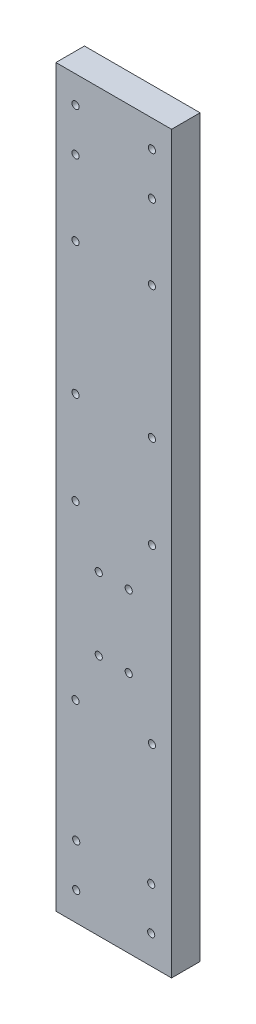
ISO-10303-21;
HEADER;
FILE_DESCRIPTION(('STEP AP214'),'2;1');
FILE_NAME('part.step','',(''),(''),'','','');
FILE_SCHEMA(('AUTOMOTIVE_DESIGN { 1 0 10303 214 1 1 1 1 }'));
ENDSEC;
DATA;
#1=APPLICATION_CONTEXT('core data for automotive mechanical design processes');
#2=APPLICATION_PROTOCOL_DEFINITION('international standard','automotive_design',2000,#1);
#3=PRODUCT_CONTEXT('',#1,'mechanical');
#4=PRODUCT('Part','Part','',(#3));
#5=PRODUCT_RELATED_PRODUCT_CATEGORY('part','',(#4));
#6=PRODUCT_DEFINITION_FORMATION('','',#4);
#7=PRODUCT_DEFINITION_CONTEXT('part definition',#1,'design');
#8=PRODUCT_DEFINITION('design','',#6,#7);
#9=PRODUCT_DEFINITION_SHAPE('','',#8);
#10=(LENGTH_UNIT() NAMED_UNIT(*) SI_UNIT(.MILLI.,.METRE.));
#11=(NAMED_UNIT(*) PLANE_ANGLE_UNIT() SI_UNIT($,.RADIAN.));
#12=(NAMED_UNIT(*) SI_UNIT($,.STERADIAN.) SOLID_ANGLE_UNIT());
#13=UNCERTAINTY_MEASURE_WITH_UNIT(LENGTH_MEASURE(1.E-05),#10,'distance_accuracy_value','');
#14=(GEOMETRIC_REPRESENTATION_CONTEXT(3) GLOBAL_UNCERTAINTY_ASSIGNED_CONTEXT((#13)) GLOBAL_UNIT_ASSIGNED_CONTEXT((#10,
#11,#12)) REPRESENTATION_CONTEXT('',''));
#15=CARTESIAN_POINT('',(0.,0.,0.));
#16=DIRECTION('',(0.,0.,1.));
#17=DIRECTION('',(1.,0.,0.));
#18=AXIS2_PLACEMENT_3D('',#15,#16,#17);
#19=CARTESIAN_POINT('',(0.,0.,4.));
#20=DIRECTION('',(0.,0.,-1.));
#21=DIRECTION('',(-1.,0.,0.));
#22=AXIS2_PLACEMENT_3D('',#19,#20,#21);
#23=PLANE('',#22);
#24=CARTESIAN_POINT('',(13.4499999999989,99.165,4.));
#25=DIRECTION('',(0.,0.,1.));
#26=DIRECTION('',(-1.,0.,0.));
#27=AXIS2_PLACEMENT_3D('',#24,#25,#26);
#28=CIRCLE('',#27,0.499999999999994);
#29=CARTESIAN_POINT('',(12.9499999999989,99.165,4.));
#30=VERTEX_POINT('',#29);
#31=EDGE_CURVE('E217',#30,#30,#28,.T.);
#32=ORIENTED_EDGE('',*,*,#31,.F.);
#33=EDGE_LOOP('',(#32));
#34=FACE_BOUND('',#33,.T.);
#35=CARTESIAN_POINT('',(13.350000000001,10.,4.));
#36=DIRECTION('',(0.,0.,1.));
#37=DIRECTION('',(-1.,0.,0.));
#38=AXIS2_PLACEMENT_3D('',#35,#36,#37);
#39=CIRCLE('',#38,0.499999999999995);
#40=CARTESIAN_POINT('',(12.850000000001,10.,4.));
#41=VERTEX_POINT('',#40);
#42=EDGE_CURVE('E205',#41,#41,#39,.T.);
#43=ORIENTED_EDGE('',*,*,#42,.F.);
#44=EDGE_LOOP('',(#43));
#45=FACE_BOUND('',#44,.T.);
#46=CARTESIAN_POINT('',(2.85,10.,4.));
#47=DIRECTION('',(0.,0.,1.));
#48=DIRECTION('',(1.,0.,0.));
#49=AXIS2_PLACEMENT_3D('',#46,#47,#48);
#50=CIRCLE('',#49,0.499999999999999);
#51=CARTESIAN_POINT('',(3.35,10.,4.));
#52=VERTEX_POINT('',#51);
#53=EDGE_CURVE('E193',#52,#52,#50,.T.);
#54=ORIENTED_EDGE('',*,*,#53,.F.);
#55=EDGE_LOOP('',(#54));
#56=FACE_BOUND('',#55,.T.);
#57=CARTESIAN_POINT('',(13.4499999999999,93.165,4.));
#58=DIRECTION('',(0.,0.,1.));
#59=DIRECTION('',(1.,0.,0.));
#60=AXIS2_PLACEMENT_3D('',#57,#58,#59);
#61=CIRCLE('',#60,0.499999999999994);
#62=CARTESIAN_POINT('',(13.9499999999999,93.165,4.));
#63=VERTEX_POINT('',#62);
#64=EDGE_CURVE('E181',#63,#63,#61,.T.);
#65=ORIENTED_EDGE('',*,*,#64,.F.);
#66=EDGE_LOOP('',(#65));
#67=FACE_BOUND('',#66,.T.);
#68=CARTESIAN_POINT('',(13.4499999999987,82.665,4.));
#69=DIRECTION('',(0.,0.,1.));
#70=DIRECTION('',(1.,0.,0.));
#71=AXIS2_PLACEMENT_3D('',#68,#69,#70);
#72=CIRCLE('',#71,0.499999999999994);
#73=CARTESIAN_POINT('',(13.9499999999987,82.665,4.));
#74=VERTEX_POINT('',#73);
#75=EDGE_CURVE('E169',#74,#74,#72,.T.);
#76=ORIENTED_EDGE('',*,*,#75,.F.);
#77=EDGE_LOOP('',(#76));
#78=FACE_BOUND('',#77,.T.);
#79=CARTESIAN_POINT('',(13.45,27.,4.));
#80=DIRECTION('',(0.,0.,1.));
#81=DIRECTION('',(1.,0.,0.));
#82=AXIS2_PLACEMENT_3D('',#79,#80,#81);
#83=CIRCLE('',#82,0.499999999999993);
#84=CARTESIAN_POINT('',(13.95,27.,4.));
#85=VERTEX_POINT('',#84);
#86=EDGE_CURVE('E157',#85,#85,#83,.T.);
#87=ORIENTED_EDGE('',*,*,#86,.F.);
#88=EDGE_LOOP('',(#87));
#89=FACE_BOUND('',#88,.T.);
#90=CARTESIAN_POINT('',(10.2,34.,4.));
#91=DIRECTION('',(0.,0.,1.));
#92=DIRECTION('',(1.,0.,0.));
#93=AXIS2_PLACEMENT_3D('',#90,#91,#92);
#94=CIRCLE('',#93,0.499999999999999);
#95=CARTESIAN_POINT('',(10.7,34.,4.));
#96=VERTEX_POINT('',#95);
#97=EDGE_CURVE('E145',#96,#96,#94,.T.);
#98=ORIENTED_EDGE('',*,*,#97,.F.);
#99=EDGE_LOOP('',(#98));
#100=FACE_BOUND('',#99,.T.);
#101=CARTESIAN_POINT('',(13.4500000000003,64.14,4.));
#102=DIRECTION('',(0.,0.,1.));
#103=DIRECTION('',(1.,0.,0.));
#104=AXIS2_PLACEMENT_3D('',#101,#102,#103);
#105=CIRCLE('',#104,0.499999999999994);
#106=CARTESIAN_POINT('',(13.9500000000003,64.14,4.));
#107=VERTEX_POINT('',#106);
#108=EDGE_CURVE('E133',#107,#107,#105,.T.);
#109=ORIENTED_EDGE('',*,*,#108,.F.);
#110=EDGE_LOOP('',(#109));
#111=FACE_BOUND('',#110,.T.);
#112=CARTESIAN_POINT('',(13.45,51.14,4.));
#113=DIRECTION('',(0.,0.,1.));
#114=DIRECTION('',(1.,0.,0.));
#115=AXIS2_PLACEMENT_3D('',#112,#113,#114);
#116=CIRCLE('',#115,0.499999999999999);
#117=CARTESIAN_POINT('',(13.95,51.14,4.));
#118=VERTEX_POINT('',#117);
#119=EDGE_CURVE('E121',#118,#118,#116,.T.);
#120=ORIENTED_EDGE('',*,*,#119,.F.);
#121=EDGE_LOOP('',(#120));
#122=FACE_BOUND('',#121,.T.);
#123=CARTESIAN_POINT('',(10.2,44.14,4.));
#124=DIRECTION('',(0.,0.,1.));
#125=DIRECTION('',(1.,0.,0.));
#126=AXIS2_PLACEMENT_3D('',#123,#124,#125);
#127=CIRCLE('',#126,0.499999999999999);
#128=CARTESIAN_POINT('',(10.7,44.14,4.));
#129=VERTEX_POINT('',#128);
#130=EDGE_CURVE('E100',#129,#129,#127,.T.);
#131=ORIENTED_EDGE('',*,*,#130,.F.);
#132=EDGE_LOOP('',(#131));
#133=FACE_BOUND('',#132,.T.);
#134=DIRECTION('',(1.,0.,0.));
#135=VECTOR('',#134,1.);
#136=CARTESIAN_POINT('',(0.,0.,4.));
#137=LINE('',#136,#135);
#138=CARTESIAN_POINT('',(0.,0.,4.));
#139=VERTEX_POINT('',#138);
#140=CARTESIAN_POINT('',(16.2,0.,4.));
#141=VERTEX_POINT('',#140);
#142=EDGE_CURVE('E85',#139,#141,#137,.T.);
#143=ORIENTED_EDGE('',*,*,#142,.T.);
#144=DIRECTION('',(0.,1.,0.));
#145=VECTOR('',#144,1.);
#146=CARTESIAN_POINT('',(16.2,102.96,4.));
#147=LINE('',#146,#145);
#148=CARTESIAN_POINT('',(16.2,102.96,4.));
#149=VERTEX_POINT('',#148);
#150=EDGE_CURVE('E80',#141,#149,#147,.T.);
#151=ORIENTED_EDGE('',*,*,#150,.T.);
#152=DIRECTION('',(-1.,0.,0.));
#153=VECTOR('',#152,1.);
#154=CARTESIAN_POINT('',(0.,102.96,4.));
#155=LINE('',#154,#153);
#156=CARTESIAN_POINT('',(0.,102.96,4.));
#157=VERTEX_POINT('',#156);
#158=EDGE_CURVE('E83',#149,#157,#155,.T.);
#159=ORIENTED_EDGE('',*,*,#158,.T.);
#160=DIRECTION('',(0.,-1.,0.));
#161=VECTOR('',#160,1.);
#162=CARTESIAN_POINT('',(0.,102.96,4.));
#163=LINE('',#162,#161);
#164=EDGE_CURVE('E50',#157,#139,#163,.T.);
#165=ORIENTED_EDGE('',*,*,#164,.T.);
#166=EDGE_LOOP('',(#143,#151,#159,#165));
#167=FACE_BOUND('',#166,.T.);
#168=CARTESIAN_POINT('',(5.99999999999999,44.14,4.));
#169=DIRECTION('',(0.,0.,1.));
#170=DIRECTION('',(1.,0.,0.));
#171=AXIS2_PLACEMENT_3D('',#168,#169,#170);
#172=CIRCLE('',#171,0.500000000000002);
#173=CARTESIAN_POINT('',(6.5,44.14,4.));
#174=VERTEX_POINT('',#173);
#175=EDGE_CURVE('E115',#174,#174,#172,.T.);
#176=ORIENTED_EDGE('',*,*,#175,.F.);
#177=EDGE_LOOP('',(#176));
#178=FACE_BOUND('',#177,.T.);
#179=CARTESIAN_POINT('',(2.74999999999999,51.14,4.));
#180=DIRECTION('',(0.,0.,1.));
#181=DIRECTION('',(1.,0.,0.));
#182=AXIS2_PLACEMENT_3D('',#179,#180,#181);
#183=CIRCLE('',#182,0.499999999999999);
#184=CARTESIAN_POINT('',(3.24999999999999,51.14,4.));
#185=VERTEX_POINT('',#184);
#186=EDGE_CURVE('E127',#185,#185,#183,.T.);
#187=ORIENTED_EDGE('',*,*,#186,.F.);
#188=EDGE_LOOP('',(#187));
#189=FACE_BOUND('',#188,.T.);
#190=CARTESIAN_POINT('',(2.74999999999999,64.14,4.));
#191=DIRECTION('',(0.,0.,1.));
#192=DIRECTION('',(1.,0.,0.));
#193=AXIS2_PLACEMENT_3D('',#190,#191,#192);
#194=CIRCLE('',#193,0.499999999999999);
#195=CARTESIAN_POINT('',(3.24999999999999,64.14,4.));
#196=VERTEX_POINT('',#195);
#197=EDGE_CURVE('E139',#196,#196,#194,.T.);
#198=ORIENTED_EDGE('',*,*,#197,.F.);
#199=EDGE_LOOP('',(#198));
#200=FACE_BOUND('',#199,.T.);
#201=CARTESIAN_POINT('',(6.,34.,4.));
#202=DIRECTION('',(0.,0.,1.));
#203=DIRECTION('',(1.,0.,0.));
#204=AXIS2_PLACEMENT_3D('',#201,#202,#203);
#205=CIRCLE('',#204,0.5);
#206=CARTESIAN_POINT('',(6.5,34.,4.));
#207=VERTEX_POINT('',#206);
#208=EDGE_CURVE('E151',#207,#207,#205,.T.);
#209=ORIENTED_EDGE('',*,*,#208,.F.);
#210=EDGE_LOOP('',(#209));
#211=FACE_BOUND('',#210,.T.);
#212=CARTESIAN_POINT('',(2.75,27.,4.));
#213=DIRECTION('',(0.,0.,1.));
#214=DIRECTION('',(1.,0.,0.));
#215=AXIS2_PLACEMENT_3D('',#212,#213,#214);
#216=CIRCLE('',#215,0.499999999999999);
#217=CARTESIAN_POINT('',(3.25,27.,4.));
#218=VERTEX_POINT('',#217);
#219=EDGE_CURVE('E163',#218,#218,#216,.T.);
#220=ORIENTED_EDGE('',*,*,#219,.F.);
#221=EDGE_LOOP('',(#220));
#222=FACE_BOUND('',#221,.T.);
#223=CARTESIAN_POINT('',(2.74999999999866,82.665,4.));
#224=DIRECTION('',(0.,0.,1.));
#225=DIRECTION('',(1.,0.,0.));
#226=AXIS2_PLACEMENT_3D('',#223,#224,#225);
#227=CIRCLE('',#226,0.499999999999999);
#228=CARTESIAN_POINT('',(3.24999999999866,82.665,4.));
#229=VERTEX_POINT('',#228);
#230=EDGE_CURVE('E175',#229,#229,#227,.T.);
#231=ORIENTED_EDGE('',*,*,#230,.F.);
#232=EDGE_LOOP('',(#231));
#233=FACE_BOUND('',#232,.T.);
#234=CARTESIAN_POINT('',(2.74999999999866,93.165,4.));
#235=DIRECTION('',(0.,0.,1.));
#236=DIRECTION('',(1.,0.,0.));
#237=AXIS2_PLACEMENT_3D('',#234,#235,#236);
#238=CIRCLE('',#237,0.499999999999999);
#239=CARTESIAN_POINT('',(3.24999999999866,93.165,4.));
#240=VERTEX_POINT('',#239);
#241=EDGE_CURVE('E187',#240,#240,#238,.T.);
#242=ORIENTED_EDGE('',*,*,#241,.F.);
#243=EDGE_LOOP('',(#242));
#244=FACE_BOUND('',#243,.T.);
#245=CARTESIAN_POINT('',(2.85,4.,4.));
#246=DIRECTION('',(0.,0.,1.));
#247=DIRECTION('',(1.,0.,0.));
#248=AXIS2_PLACEMENT_3D('',#245,#246,#247);
#249=CIRCLE('',#248,0.499999999999999);
#250=CARTESIAN_POINT('',(3.35,4.,4.));
#251=VERTEX_POINT('',#250);
#252=EDGE_CURVE('E199',#251,#251,#249,.T.);
#253=ORIENTED_EDGE('',*,*,#252,.F.);
#254=EDGE_LOOP('',(#253));
#255=FACE_BOUND('',#254,.T.);
#256=CARTESIAN_POINT('',(13.350000000001,4.,4.));
#257=DIRECTION('',(0.,0.,1.));
#258=DIRECTION('',(-1.,0.,0.));
#259=AXIS2_PLACEMENT_3D('',#256,#257,#258);
#260=CIRCLE('',#259,0.499999999999999);
#261=CARTESIAN_POINT('',(12.850000000001,4.,4.));
#262=VERTEX_POINT('',#261);
#263=EDGE_CURVE('E211',#262,#262,#260,.T.);
#264=ORIENTED_EDGE('',*,*,#263,.F.);
#265=EDGE_LOOP('',(#264));
#266=FACE_BOUND('',#265,.T.);
#267=CARTESIAN_POINT('',(2.74999999999866,99.165,4.));
#268=DIRECTION('',(0.,0.,1.));
#269=DIRECTION('',(-1.,0.,0.));
#270=AXIS2_PLACEMENT_3D('',#267,#268,#269);
#271=CIRCLE('',#270,0.499999999999999);
#272=CARTESIAN_POINT('',(2.24999999999866,99.165,4.));
#273=VERTEX_POINT('',#272);
#274=EDGE_CURVE('E223',#273,#273,#271,.T.);
#275=ORIENTED_EDGE('',*,*,#274,.F.);
#276=EDGE_LOOP('',(#275));
#277=FACE_BOUND('',#276,.T.);
#278=ADVANCED_FACE('F33',(#34,#45,#56,#67,#78,#89,#100,#111,#122,#133,#167,#178,#189,#200,#211,
#222,#233,#244,#255,#266,#277),#23,.F.);
#279=CARTESIAN_POINT('',(0.,0.,0.));
#280=DIRECTION('',(0.,0.,-1.));
#281=DIRECTION('',(-1.,0.,0.));
#282=AXIS2_PLACEMENT_3D('',#279,#280,#281);
#283=PLANE('',#282);
#284=CARTESIAN_POINT('',(13.4499999999989,99.165,0.));
#285=DIRECTION('',(0.,0.,1.));
#286=DIRECTION('',(-1.,0.,0.));
#287=AXIS2_PLACEMENT_3D('',#284,#285,#286);
#288=CIRCLE('',#287,0.499999999999994);
#289=CARTESIAN_POINT('',(12.9499999999989,99.165,0.));
#290=VERTEX_POINT('',#289);
#291=EDGE_CURVE('E220',#290,#290,#288,.T.);
#292=ORIENTED_EDGE('',*,*,#291,.T.);
#293=EDGE_LOOP('',(#292));
#294=FACE_BOUND('',#293,.T.);
#295=CARTESIAN_POINT('',(13.350000000001,10.,0.));
#296=DIRECTION('',(0.,0.,1.));
#297=DIRECTION('',(-1.,0.,0.));
#298=AXIS2_PLACEMENT_3D('',#295,#296,#297);
#299=CIRCLE('',#298,0.499999999999995);
#300=CARTESIAN_POINT('',(12.850000000001,10.,0.));
#301=VERTEX_POINT('',#300);
#302=EDGE_CURVE('E208',#301,#301,#299,.T.);
#303=ORIENTED_EDGE('',*,*,#302,.T.);
#304=EDGE_LOOP('',(#303));
#305=FACE_BOUND('',#304,.T.);
#306=CARTESIAN_POINT('',(2.85,10.,0.));
#307=DIRECTION('',(0.,0.,1.));
#308=DIRECTION('',(1.,0.,0.));
#309=AXIS2_PLACEMENT_3D('',#306,#307,#308);
#310=CIRCLE('',#309,0.499999999999999);
#311=CARTESIAN_POINT('',(3.35,10.,0.));
#312=VERTEX_POINT('',#311);
#313=EDGE_CURVE('E196',#312,#312,#310,.T.);
#314=ORIENTED_EDGE('',*,*,#313,.T.);
#315=EDGE_LOOP('',(#314));
#316=FACE_BOUND('',#315,.T.);
#317=CARTESIAN_POINT('',(13.4499999999999,93.165,0.));
#318=DIRECTION('',(0.,0.,1.));
#319=DIRECTION('',(1.,0.,0.));
#320=AXIS2_PLACEMENT_3D('',#317,#318,#319);
#321=CIRCLE('',#320,0.499999999999994);
#322=CARTESIAN_POINT('',(13.9499999999999,93.165,0.));
#323=VERTEX_POINT('',#322);
#324=EDGE_CURVE('E184',#323,#323,#321,.T.);
#325=ORIENTED_EDGE('',*,*,#324,.T.);
#326=EDGE_LOOP('',(#325));
#327=FACE_BOUND('',#326,.T.);
#328=CARTESIAN_POINT('',(13.4499999999987,82.665,0.));
#329=DIRECTION('',(0.,0.,1.));
#330=DIRECTION('',(1.,0.,0.));
#331=AXIS2_PLACEMENT_3D('',#328,#329,#330);
#332=CIRCLE('',#331,0.499999999999994);
#333=CARTESIAN_POINT('',(13.9499999999987,82.665,0.));
#334=VERTEX_POINT('',#333);
#335=EDGE_CURVE('E172',#334,#334,#332,.T.);
#336=ORIENTED_EDGE('',*,*,#335,.T.);
#337=EDGE_LOOP('',(#336));
#338=FACE_BOUND('',#337,.T.);
#339=CARTESIAN_POINT('',(13.45,27.,0.));
#340=DIRECTION('',(0.,0.,1.));
#341=DIRECTION('',(1.,0.,0.));
#342=AXIS2_PLACEMENT_3D('',#339,#340,#341);
#343=CIRCLE('',#342,0.499999999999993);
#344=CARTESIAN_POINT('',(13.95,27.,0.));
#345=VERTEX_POINT('',#344);
#346=EDGE_CURVE('E160',#345,#345,#343,.T.);
#347=ORIENTED_EDGE('',*,*,#346,.T.);
#348=EDGE_LOOP('',(#347));
#349=FACE_BOUND('',#348,.T.);
#350=CARTESIAN_POINT('',(10.2,34.,0.));
#351=DIRECTION('',(0.,0.,1.));
#352=DIRECTION('',(1.,0.,0.));
#353=AXIS2_PLACEMENT_3D('',#350,#351,#352);
#354=CIRCLE('',#353,0.499999999999999);
#355=CARTESIAN_POINT('',(10.7,34.,0.));
#356=VERTEX_POINT('',#355);
#357=EDGE_CURVE('E148',#356,#356,#354,.T.);
#358=ORIENTED_EDGE('',*,*,#357,.T.);
#359=EDGE_LOOP('',(#358));
#360=FACE_BOUND('',#359,.T.);
#361=CARTESIAN_POINT('',(13.4500000000003,64.14,0.));
#362=DIRECTION('',(0.,0.,1.));
#363=DIRECTION('',(1.,0.,0.));
#364=AXIS2_PLACEMENT_3D('',#361,#362,#363);
#365=CIRCLE('',#364,0.499999999999994);
#366=CARTESIAN_POINT('',(13.9500000000003,64.14,0.));
#367=VERTEX_POINT('',#366);
#368=EDGE_CURVE('E136',#367,#367,#365,.T.);
#369=ORIENTED_EDGE('',*,*,#368,.T.);
#370=EDGE_LOOP('',(#369));
#371=FACE_BOUND('',#370,.T.);
#372=CARTESIAN_POINT('',(13.45,51.14,0.));
#373=DIRECTION('',(0.,0.,1.));
#374=DIRECTION('',(1.,0.,0.));
#375=AXIS2_PLACEMENT_3D('',#372,#373,#374);
#376=CIRCLE('',#375,0.499999999999999);
#377=CARTESIAN_POINT('',(13.95,51.14,0.));
#378=VERTEX_POINT('',#377);
#379=EDGE_CURVE('E124',#378,#378,#376,.T.);
#380=ORIENTED_EDGE('',*,*,#379,.T.);
#381=EDGE_LOOP('',(#380));
#382=FACE_BOUND('',#381,.T.);
#383=CARTESIAN_POINT('',(10.2,44.14,0.));
#384=DIRECTION('',(0.,0.,1.));
#385=DIRECTION('',(1.,0.,0.));
#386=AXIS2_PLACEMENT_3D('',#383,#384,#385);
#387=CIRCLE('',#386,0.499999999999999);
#388=CARTESIAN_POINT('',(10.7,44.14,0.));
#389=VERTEX_POINT('',#388);
#390=EDGE_CURVE('E112',#389,#389,#387,.T.);
#391=ORIENTED_EDGE('',*,*,#390,.T.);
#392=EDGE_LOOP('',(#391));
#393=FACE_BOUND('',#392,.T.);
#394=DIRECTION('',(1.,0.,0.));
#395=VECTOR('',#394,1.);
#396=CARTESIAN_POINT('',(0.,0.,0.));
#397=LINE('',#396,#395);
#398=CARTESIAN_POINT('',(0.,0.,0.));
#399=VERTEX_POINT('',#398);
#400=CARTESIAN_POINT('',(16.2,0.,0.));
#401=VERTEX_POINT('',#400);
#402=EDGE_CURVE('E97',#399,#401,#397,.T.);
#403=ORIENTED_EDGE('',*,*,#402,.F.);
#404=DIRECTION('',(0.,-1.,0.));
#405=VECTOR('',#404,1.);
#406=CARTESIAN_POINT('',(0.,102.96,0.));
#407=LINE('',#406,#405);
#408=CARTESIAN_POINT('',(0.,102.96,0.));
#409=VERTEX_POINT('',#408);
#410=EDGE_CURVE('E73',#409,#399,#407,.T.);
#411=ORIENTED_EDGE('',*,*,#410,.F.);
#412=DIRECTION('',(-1.,0.,0.));
#413=VECTOR('',#412,1.);
#414=CARTESIAN_POINT('',(0.,102.96,0.));
#415=LINE('',#414,#413);
#416=CARTESIAN_POINT('',(16.2,102.96,0.));
#417=VERTEX_POINT('',#416);
#418=EDGE_CURVE('E67',#417,#409,#415,.T.);
#419=ORIENTED_EDGE('',*,*,#418,.F.);
#420=DIRECTION('',(0.,1.,0.));
#421=VECTOR('',#420,1.);
#422=CARTESIAN_POINT('',(16.2,102.96,0.));
#423=LINE('',#422,#421);
#424=EDGE_CURVE('E89',#401,#417,#423,.T.);
#425=ORIENTED_EDGE('',*,*,#424,.F.);
#426=EDGE_LOOP('',(#403,#411,#419,#425));
#427=FACE_BOUND('',#426,.T.);
#428=CARTESIAN_POINT('',(5.99999999999999,44.14,0.));
#429=DIRECTION('',(0.,0.,1.));
#430=DIRECTION('',(1.,0.,0.));
#431=AXIS2_PLACEMENT_3D('',#428,#429,#430);
#432=CIRCLE('',#431,0.500000000000002);
#433=CARTESIAN_POINT('',(6.5,44.14,0.));
#434=VERTEX_POINT('',#433);
#435=EDGE_CURVE('E118',#434,#434,#432,.T.);
#436=ORIENTED_EDGE('',*,*,#435,.T.);
#437=EDGE_LOOP('',(#436));
#438=FACE_BOUND('',#437,.T.);
#439=CARTESIAN_POINT('',(2.74999999999999,51.14,0.));
#440=DIRECTION('',(0.,0.,1.));
#441=DIRECTION('',(1.,0.,0.));
#442=AXIS2_PLACEMENT_3D('',#439,#440,#441);
#443=CIRCLE('',#442,0.499999999999999);
#444=CARTESIAN_POINT('',(3.24999999999999,51.14,0.));
#445=VERTEX_POINT('',#444);
#446=EDGE_CURVE('E130',#445,#445,#443,.T.);
#447=ORIENTED_EDGE('',*,*,#446,.T.);
#448=EDGE_LOOP('',(#447));
#449=FACE_BOUND('',#448,.T.);
#450=CARTESIAN_POINT('',(2.74999999999999,64.14,0.));
#451=DIRECTION('',(0.,0.,1.));
#452=DIRECTION('',(1.,0.,0.));
#453=AXIS2_PLACEMENT_3D('',#450,#451,#452);
#454=CIRCLE('',#453,0.499999999999999);
#455=CARTESIAN_POINT('',(3.24999999999999,64.14,0.));
#456=VERTEX_POINT('',#455);
#457=EDGE_CURVE('E142',#456,#456,#454,.T.);
#458=ORIENTED_EDGE('',*,*,#457,.T.);
#459=EDGE_LOOP('',(#458));
#460=FACE_BOUND('',#459,.T.);
#461=CARTESIAN_POINT('',(6.,34.,0.));
#462=DIRECTION('',(0.,0.,1.));
#463=DIRECTION('',(1.,0.,0.));
#464=AXIS2_PLACEMENT_3D('',#461,#462,#463);
#465=CIRCLE('',#464,0.5);
#466=CARTESIAN_POINT('',(6.5,34.,0.));
#467=VERTEX_POINT('',#466);
#468=EDGE_CURVE('E154',#467,#467,#465,.T.);
#469=ORIENTED_EDGE('',*,*,#468,.T.);
#470=EDGE_LOOP('',(#469));
#471=FACE_BOUND('',#470,.T.);
#472=CARTESIAN_POINT('',(2.75,27.,0.));
#473=DIRECTION('',(0.,0.,1.));
#474=DIRECTION('',(1.,0.,0.));
#475=AXIS2_PLACEMENT_3D('',#472,#473,#474);
#476=CIRCLE('',#475,0.499999999999999);
#477=CARTESIAN_POINT('',(3.25,27.,0.));
#478=VERTEX_POINT('',#477);
#479=EDGE_CURVE('E166',#478,#478,#476,.T.);
#480=ORIENTED_EDGE('',*,*,#479,.T.);
#481=EDGE_LOOP('',(#480));
#482=FACE_BOUND('',#481,.T.);
#483=CARTESIAN_POINT('',(2.74999999999866,82.665,0.));
#484=DIRECTION('',(0.,0.,1.));
#485=DIRECTION('',(1.,0.,0.));
#486=AXIS2_PLACEMENT_3D('',#483,#484,#485);
#487=CIRCLE('',#486,0.499999999999999);
#488=CARTESIAN_POINT('',(3.24999999999866,82.665,0.));
#489=VERTEX_POINT('',#488);
#490=EDGE_CURVE('E178',#489,#489,#487,.T.);
#491=ORIENTED_EDGE('',*,*,#490,.T.);
#492=EDGE_LOOP('',(#491));
#493=FACE_BOUND('',#492,.T.);
#494=CARTESIAN_POINT('',(2.74999999999866,93.165,0.));
#495=DIRECTION('',(0.,0.,1.));
#496=DIRECTION('',(1.,0.,0.));
#497=AXIS2_PLACEMENT_3D('',#494,#495,#496);
#498=CIRCLE('',#497,0.499999999999999);
#499=CARTESIAN_POINT('',(3.24999999999866,93.165,0.));
#500=VERTEX_POINT('',#499);
#501=EDGE_CURVE('E190',#500,#500,#498,.T.);
#502=ORIENTED_EDGE('',*,*,#501,.T.);
#503=EDGE_LOOP('',(#502));
#504=FACE_BOUND('',#503,.T.);
#505=CARTESIAN_POINT('',(2.85,4.,0.));
#506=DIRECTION('',(0.,0.,1.));
#507=DIRECTION('',(1.,0.,0.));
#508=AXIS2_PLACEMENT_3D('',#505,#506,#507);
#509=CIRCLE('',#508,0.499999999999999);
#510=CARTESIAN_POINT('',(3.35,4.,0.));
#511=VERTEX_POINT('',#510);
#512=EDGE_CURVE('E202',#511,#511,#509,.T.);
#513=ORIENTED_EDGE('',*,*,#512,.T.);
#514=EDGE_LOOP('',(#513));
#515=FACE_BOUND('',#514,.T.);
#516=CARTESIAN_POINT('',(13.350000000001,4.,0.));
#517=DIRECTION('',(0.,0.,1.));
#518=DIRECTION('',(-1.,0.,0.));
#519=AXIS2_PLACEMENT_3D('',#516,#517,#518);
#520=CIRCLE('',#519,0.499999999999999);
#521=CARTESIAN_POINT('',(12.850000000001,4.,0.));
#522=VERTEX_POINT('',#521);
#523=EDGE_CURVE('E214',#522,#522,#520,.T.);
#524=ORIENTED_EDGE('',*,*,#523,.T.);
#525=EDGE_LOOP('',(#524));
#526=FACE_BOUND('',#525,.T.);
#527=CARTESIAN_POINT('',(2.74999999999866,99.165,0.));
#528=DIRECTION('',(0.,0.,1.));
#529=DIRECTION('',(-1.,0.,0.));
#530=AXIS2_PLACEMENT_3D('',#527,#528,#529);
#531=CIRCLE('',#530,0.499999999999999);
#532=CARTESIAN_POINT('',(2.24999999999866,99.165,0.));
#533=VERTEX_POINT('',#532);
#534=EDGE_CURVE('E226',#533,#533,#531,.T.);
#535=ORIENTED_EDGE('',*,*,#534,.T.);
#536=EDGE_LOOP('',(#535));
#537=FACE_BOUND('',#536,.T.);
#538=ADVANCED_FACE('F108',(#294,#305,#316,#327,#338,#349,#360,#371,#382,#393,#427,#438,#449,
#460,#471,#482,#493,#504,#515,#526,#537),#283,.T.);
#539=CARTESIAN_POINT('',(0.,0.,4.));
#540=DIRECTION('',(0.,1.,0.));
#541=DIRECTION('',(-1.,0.,0.));
#542=AXIS2_PLACEMENT_3D('',#539,#540,#541);
#543=PLANE('',#542);
#544=ORIENTED_EDGE('',*,*,#402,.T.);
#545=DIRECTION('',(0.,0.,-1.));
#546=VECTOR('',#545,1.);
#547=CARTESIAN_POINT('',(16.2,0.,4.));
#548=LINE('',#547,#546);
#549=EDGE_CURVE('E11',#141,#401,#548,.T.);
#550=ORIENTED_EDGE('',*,*,#549,.F.);
#551=ORIENTED_EDGE('',*,*,#142,.F.);
#552=DIRECTION('',(0.,0.,-1.));
#553=VECTOR('',#552,1.);
#554=CARTESIAN_POINT('',(0.,0.,4.));
#555=LINE('',#554,#553);
#556=EDGE_CURVE('E93',#139,#399,#555,.T.);
#557=ORIENTED_EDGE('',*,*,#556,.T.);
#558=EDGE_LOOP('',(#544,#550,#551,#557));
#559=FACE_BOUND('',#558,.T.);
#560=ADVANCED_FACE('F35',(#559),#543,.F.);
#561=CARTESIAN_POINT('',(16.2,102.96,4.));
#562=DIRECTION('',(-1.,0.,0.));
#563=DIRECTION('',(0.,-1.,0.));
#564=AXIS2_PLACEMENT_3D('',#561,#562,#563);
#565=PLANE('',#564);
#566=ORIENTED_EDGE('',*,*,#424,.T.);
#567=DIRECTION('',(0.,0.,-1.));
#568=VECTOR('',#567,1.);
#569=CARTESIAN_POINT('',(16.2,102.96,4.));
#570=LINE('',#569,#568);
#571=EDGE_CURVE('E42',#149,#417,#570,.T.);
#572=ORIENTED_EDGE('',*,*,#571,.F.);
#573=ORIENTED_EDGE('',*,*,#150,.F.);
#574=ORIENTED_EDGE('',*,*,#549,.T.);
#575=EDGE_LOOP('',(#566,#572,#573,#574));
#576=FACE_BOUND('',#575,.T.);
#577=ADVANCED_FACE('F88',(#576),#565,.F.);
#578=CARTESIAN_POINT('',(0.,102.96,4.));
#579=DIRECTION('',(0.,-1.,0.));
#580=DIRECTION('',(0.,0.,-1.));
#581=AXIS2_PLACEMENT_3D('',#578,#579,#580);
#582=PLANE('',#581);
#583=ORIENTED_EDGE('',*,*,#418,.T.);
#584=DIRECTION('',(0.,0.,-1.));
#585=VECTOR('',#584,1.);
#586=CARTESIAN_POINT('',(0.,102.96,4.));
#587=LINE('',#586,#585);
#588=EDGE_CURVE('E90',#157,#409,#587,.T.);
#589=ORIENTED_EDGE('',*,*,#588,.F.);
#590=ORIENTED_EDGE('',*,*,#158,.F.);
#591=ORIENTED_EDGE('',*,*,#571,.T.);
#592=EDGE_LOOP('',(#583,#589,#590,#591));
#593=FACE_BOUND('',#592,.T.);
#594=ADVANCED_FACE('F91',(#593),#582,.F.);
#595=CARTESIAN_POINT('',(0.,102.96,4.));
#596=DIRECTION('',(1.,0.,0.));
#597=DIRECTION('',(0.,1.,0.));
#598=AXIS2_PLACEMENT_3D('',#595,#596,#597);
#599=PLANE('',#598);
#600=ORIENTED_EDGE('',*,*,#410,.T.);
#601=ORIENTED_EDGE('',*,*,#556,.F.);
#602=ORIENTED_EDGE('',*,*,#164,.F.);
#603=ORIENTED_EDGE('',*,*,#588,.T.);
#604=EDGE_LOOP('',(#600,#601,#602,#603));
#605=FACE_BOUND('',#604,.T.);
#606=ADVANCED_FACE('F105',(#605),#599,.F.);
#607=CARTESIAN_POINT('',(10.2,44.14,4.));
#608=DIRECTION('',(0.,0.,-1.));
#609=DIRECTION('',(-1.,0.,0.));
#610=AXIS2_PLACEMENT_3D('',#607,#608,#609);
#611=CYLINDRICAL_SURFACE('',#610,0.499999999999999);
#612=ORIENTED_EDGE('',*,*,#130,.T.);
#613=EDGE_LOOP('',(#612));
#614=FACE_BOUND('',#613,.T.);
#615=ORIENTED_EDGE('',*,*,#390,.F.);
#616=EDGE_LOOP('',(#615));
#617=FACE_BOUND('',#616,.T.);
#618=ADVANCED_FACE('F246',(#614,#617),#611,.F.);
#619=CARTESIAN_POINT('',(5.99999999999999,44.14,4.));
#620=DIRECTION('',(0.,0.,-1.));
#621=DIRECTION('',(-1.,0.,0.));
#622=AXIS2_PLACEMENT_3D('',#619,#620,#621);
#623=CYLINDRICAL_SURFACE('',#622,0.500000000000002);
#624=ORIENTED_EDGE('',*,*,#175,.T.);
#625=EDGE_LOOP('',(#624));
#626=FACE_BOUND('',#625,.T.);
#627=ORIENTED_EDGE('',*,*,#435,.F.);
#628=EDGE_LOOP('',(#627));
#629=FACE_BOUND('',#628,.T.);
#630=ADVANCED_FACE('F292',(#626,#629),#623,.F.);
#631=CARTESIAN_POINT('',(13.45,51.14,4.));
#632=DIRECTION('',(0.,0.,-1.));
#633=DIRECTION('',(-1.,0.,0.));
#634=AXIS2_PLACEMENT_3D('',#631,#632,#633);
#635=CYLINDRICAL_SURFACE('',#634,0.499999999999999);
#636=ORIENTED_EDGE('',*,*,#119,.T.);
#637=EDGE_LOOP('',(#636));
#638=FACE_BOUND('',#637,.T.);
#639=ORIENTED_EDGE('',*,*,#379,.F.);
#640=EDGE_LOOP('',(#639));
#641=FACE_BOUND('',#640,.T.);
#642=ADVANCED_FACE('F300',(#638,#641),#635,.F.);
#643=CARTESIAN_POINT('',(2.74999999999999,51.14,4.));
#644=DIRECTION('',(0.,0.,-1.));
#645=DIRECTION('',(-1.,0.,0.));
#646=AXIS2_PLACEMENT_3D('',#643,#644,#645);
#647=CYLINDRICAL_SURFACE('',#646,0.499999999999999);
#648=ORIENTED_EDGE('',*,*,#186,.T.);
#649=EDGE_LOOP('',(#648));
#650=FACE_BOUND('',#649,.T.);
#651=ORIENTED_EDGE('',*,*,#446,.F.);
#652=EDGE_LOOP('',(#651));
#653=FACE_BOUND('',#652,.T.);
#654=ADVANCED_FACE('F308',(#650,#653),#647,.F.);
#655=CARTESIAN_POINT('',(13.4500000000003,64.14,4.));
#656=DIRECTION('',(0.,0.,-1.));
#657=DIRECTION('',(-1.,0.,0.));
#658=AXIS2_PLACEMENT_3D('',#655,#656,#657);
#659=CYLINDRICAL_SURFACE('',#658,0.499999999999994);
#660=ORIENTED_EDGE('',*,*,#108,.T.);
#661=EDGE_LOOP('',(#660));
#662=FACE_BOUND('',#661,.T.);
#663=ORIENTED_EDGE('',*,*,#368,.F.);
#664=EDGE_LOOP('',(#663));
#665=FACE_BOUND('',#664,.T.);
#666=ADVANCED_FACE('F317',(#662,#665),#659,.F.);
#667=CARTESIAN_POINT('',(2.74999999999999,64.14,4.));
#668=DIRECTION('',(0.,0.,-1.));
#669=DIRECTION('',(-1.,0.,0.));
#670=AXIS2_PLACEMENT_3D('',#667,#668,#669);
#671=CYLINDRICAL_SURFACE('',#670,0.499999999999999);
#672=ORIENTED_EDGE('',*,*,#197,.T.);
#673=EDGE_LOOP('',(#672));
#674=FACE_BOUND('',#673,.T.);
#675=ORIENTED_EDGE('',*,*,#457,.F.);
#676=EDGE_LOOP('',(#675));
#677=FACE_BOUND('',#676,.T.);
#678=ADVANCED_FACE('F326',(#674,#677),#671,.F.);
#679=CARTESIAN_POINT('',(10.2,34.,4.));
#680=DIRECTION('',(0.,0.,-1.));
#681=DIRECTION('',(-1.,0.,0.));
#682=AXIS2_PLACEMENT_3D('',#679,#680,#681);
#683=CYLINDRICAL_SURFACE('',#682,0.499999999999999);
#684=ORIENTED_EDGE('',*,*,#97,.T.);
#685=EDGE_LOOP('',(#684));
#686=FACE_BOUND('',#685,.T.);
#687=ORIENTED_EDGE('',*,*,#357,.F.);
#688=EDGE_LOOP('',(#687));
#689=FACE_BOUND('',#688,.T.);
#690=ADVANCED_FACE('F335',(#686,#689),#683,.F.);
#691=CARTESIAN_POINT('',(6.,34.,4.));
#692=DIRECTION('',(0.,0.,-1.));
#693=DIRECTION('',(-1.,0.,0.));
#694=AXIS2_PLACEMENT_3D('',#691,#692,#693);
#695=CYLINDRICAL_SURFACE('',#694,0.5);
#696=ORIENTED_EDGE('',*,*,#208,.T.);
#697=EDGE_LOOP('',(#696));
#698=FACE_BOUND('',#697,.T.);
#699=ORIENTED_EDGE('',*,*,#468,.F.);
#700=EDGE_LOOP('',(#699));
#701=FACE_BOUND('',#700,.T.);
#702=ADVANCED_FACE('F344',(#698,#701),#695,.F.);
#703=CARTESIAN_POINT('',(13.45,27.,4.));
#704=DIRECTION('',(0.,0.,-1.));
#705=DIRECTION('',(-1.,0.,0.));
#706=AXIS2_PLACEMENT_3D('',#703,#704,#705);
#707=CYLINDRICAL_SURFACE('',#706,0.499999999999993);
#708=ORIENTED_EDGE('',*,*,#86,.T.);
#709=EDGE_LOOP('',(#708));
#710=FACE_BOUND('',#709,.T.);
#711=ORIENTED_EDGE('',*,*,#346,.F.);
#712=EDGE_LOOP('',(#711));
#713=FACE_BOUND('',#712,.T.);
#714=ADVANCED_FACE('F353',(#710,#713),#707,.F.);
#715=CARTESIAN_POINT('',(2.75,27.,4.));
#716=DIRECTION('',(0.,0.,-1.));
#717=DIRECTION('',(-1.,0.,0.));
#718=AXIS2_PLACEMENT_3D('',#715,#716,#717);
#719=CYLINDRICAL_SURFACE('',#718,0.499999999999999);
#720=ORIENTED_EDGE('',*,*,#219,.T.);
#721=EDGE_LOOP('',(#720));
#722=FACE_BOUND('',#721,.T.);
#723=ORIENTED_EDGE('',*,*,#479,.F.);
#724=EDGE_LOOP('',(#723));
#725=FACE_BOUND('',#724,.T.);
#726=ADVANCED_FACE('F362',(#722,#725),#719,.F.);
#727=CARTESIAN_POINT('',(13.4499999999987,82.665,4.));
#728=DIRECTION('',(0.,0.,-1.));
#729=DIRECTION('',(-1.,0.,0.));
#730=AXIS2_PLACEMENT_3D('',#727,#728,#729);
#731=CYLINDRICAL_SURFACE('',#730,0.499999999999994);
#732=ORIENTED_EDGE('',*,*,#75,.T.);
#733=EDGE_LOOP('',(#732));
#734=FACE_BOUND('',#733,.T.);
#735=ORIENTED_EDGE('',*,*,#335,.F.);
#736=EDGE_LOOP('',(#735));
#737=FACE_BOUND('',#736,.T.);
#738=ADVANCED_FACE('F371',(#734,#737),#731,.F.);
#739=CARTESIAN_POINT('',(2.74999999999866,82.665,4.));
#740=DIRECTION('',(0.,0.,-1.));
#741=DIRECTION('',(-1.,0.,0.));
#742=AXIS2_PLACEMENT_3D('',#739,#740,#741);
#743=CYLINDRICAL_SURFACE('',#742,0.499999999999999);
#744=ORIENTED_EDGE('',*,*,#230,.T.);
#745=EDGE_LOOP('',(#744));
#746=FACE_BOUND('',#745,.T.);
#747=ORIENTED_EDGE('',*,*,#490,.F.);
#748=EDGE_LOOP('',(#747));
#749=FACE_BOUND('',#748,.T.);
#750=ADVANCED_FACE('F380',(#746,#749),#743,.F.);
#751=CARTESIAN_POINT('',(13.4499999999999,93.165,4.));
#752=DIRECTION('',(0.,0.,-1.));
#753=DIRECTION('',(-1.,0.,0.));
#754=AXIS2_PLACEMENT_3D('',#751,#752,#753);
#755=CYLINDRICAL_SURFACE('',#754,0.499999999999994);
#756=ORIENTED_EDGE('',*,*,#64,.T.);
#757=EDGE_LOOP('',(#756));
#758=FACE_BOUND('',#757,.T.);
#759=ORIENTED_EDGE('',*,*,#324,.F.);
#760=EDGE_LOOP('',(#759));
#761=FACE_BOUND('',#760,.T.);
#762=ADVANCED_FACE('F389',(#758,#761),#755,.F.);
#763=CARTESIAN_POINT('',(2.74999999999866,93.165,4.));
#764=DIRECTION('',(0.,0.,-1.));
#765=DIRECTION('',(-1.,0.,0.));
#766=AXIS2_PLACEMENT_3D('',#763,#764,#765);
#767=CYLINDRICAL_SURFACE('',#766,0.499999999999999);
#768=ORIENTED_EDGE('',*,*,#241,.T.);
#769=EDGE_LOOP('',(#768));
#770=FACE_BOUND('',#769,.T.);
#771=ORIENTED_EDGE('',*,*,#501,.F.);
#772=EDGE_LOOP('',(#771));
#773=FACE_BOUND('',#772,.T.);
#774=ADVANCED_FACE('F398',(#770,#773),#767,.F.);
#775=CARTESIAN_POINT('',(2.85,10.,4.));
#776=DIRECTION('',(0.,0.,-1.));
#777=DIRECTION('',(-1.,0.,0.));
#778=AXIS2_PLACEMENT_3D('',#775,#776,#777);
#779=CYLINDRICAL_SURFACE('',#778,0.499999999999999);
#780=ORIENTED_EDGE('',*,*,#53,.T.);
#781=EDGE_LOOP('',(#780));
#782=FACE_BOUND('',#781,.T.);
#783=ORIENTED_EDGE('',*,*,#313,.F.);
#784=EDGE_LOOP('',(#783));
#785=FACE_BOUND('',#784,.T.);
#786=ADVANCED_FACE('F407',(#782,#785),#779,.F.);
#787=CARTESIAN_POINT('',(2.85,4.,4.));
#788=DIRECTION('',(0.,0.,-1.));
#789=DIRECTION('',(-1.,0.,0.));
#790=AXIS2_PLACEMENT_3D('',#787,#788,#789);
#791=CYLINDRICAL_SURFACE('',#790,0.499999999999999);
#792=ORIENTED_EDGE('',*,*,#252,.T.);
#793=EDGE_LOOP('',(#792));
#794=FACE_BOUND('',#793,.T.);
#795=ORIENTED_EDGE('',*,*,#512,.F.);
#796=EDGE_LOOP('',(#795));
#797=FACE_BOUND('',#796,.T.);
#798=ADVANCED_FACE('F416',(#794,#797),#791,.F.);
#799=CARTESIAN_POINT('',(13.350000000001,10.,4.));
#800=DIRECTION('',(0.,0.,-1.));
#801=DIRECTION('',(-1.,0.,0.));
#802=AXIS2_PLACEMENT_3D('',#799,#800,#801);
#803=CYLINDRICAL_SURFACE('',#802,0.499999999999995);
#804=ORIENTED_EDGE('',*,*,#42,.T.);
#805=EDGE_LOOP('',(#804));
#806=FACE_BOUND('',#805,.T.);
#807=ORIENTED_EDGE('',*,*,#302,.F.);
#808=EDGE_LOOP('',(#807));
#809=FACE_BOUND('',#808,.T.);
#810=ADVANCED_FACE('F425',(#806,#809),#803,.F.);
#811=CARTESIAN_POINT('',(13.350000000001,4.,4.));
#812=DIRECTION('',(0.,0.,-1.));
#813=DIRECTION('',(-1.,0.,0.));
#814=AXIS2_PLACEMENT_3D('',#811,#812,#813);
#815=CYLINDRICAL_SURFACE('',#814,0.499999999999999);
#816=ORIENTED_EDGE('',*,*,#263,.T.);
#817=EDGE_LOOP('',(#816));
#818=FACE_BOUND('',#817,.T.);
#819=ORIENTED_EDGE('',*,*,#523,.F.);
#820=EDGE_LOOP('',(#819));
#821=FACE_BOUND('',#820,.T.);
#822=ADVANCED_FACE('F434',(#818,#821),#815,.F.);
#823=CARTESIAN_POINT('',(13.4499999999989,99.165,4.));
#824=DIRECTION('',(0.,0.,-1.));
#825=DIRECTION('',(-1.,0.,0.));
#826=AXIS2_PLACEMENT_3D('',#823,#824,#825);
#827=CYLINDRICAL_SURFACE('',#826,0.499999999999994);
#828=ORIENTED_EDGE('',*,*,#31,.T.);
#829=EDGE_LOOP('',(#828));
#830=FACE_BOUND('',#829,.T.);
#831=ORIENTED_EDGE('',*,*,#291,.F.);
#832=EDGE_LOOP('',(#831));
#833=FACE_BOUND('',#832,.T.);
#834=ADVANCED_FACE('F443',(#830,#833),#827,.F.);
#835=CARTESIAN_POINT('',(2.74999999999866,99.165,4.));
#836=DIRECTION('',(0.,0.,-1.));
#837=DIRECTION('',(-1.,0.,0.));
#838=AXIS2_PLACEMENT_3D('',#835,#836,#837);
#839=CYLINDRICAL_SURFACE('',#838,0.499999999999999);
#840=ORIENTED_EDGE('',*,*,#274,.T.);
#841=EDGE_LOOP('',(#840));
#842=FACE_BOUND('',#841,.T.);
#843=ORIENTED_EDGE('',*,*,#534,.F.);
#844=EDGE_LOOP('',(#843));
#845=FACE_BOUND('',#844,.T.);
#846=ADVANCED_FACE('F232',(#842,#845),#839,.F.);
#847=CLOSED_SHELL('',(#278,#538,#560,#577,#594,#606,#618,#630,#642,#654,#666,#678,#690,#702,
#714,#726,#738,#750,#762,#774,#786,#798,#810,#822,#834,#846));
#848=MANIFOLD_SOLID_BREP('B2',#847);
#849=ADVANCED_BREP_SHAPE_REPRESENTATION('',(#18,#848),#14);
#850=SHAPE_DEFINITION_REPRESENTATION(#9,#849);
ENDSEC;
END-ISO-10303-21;
